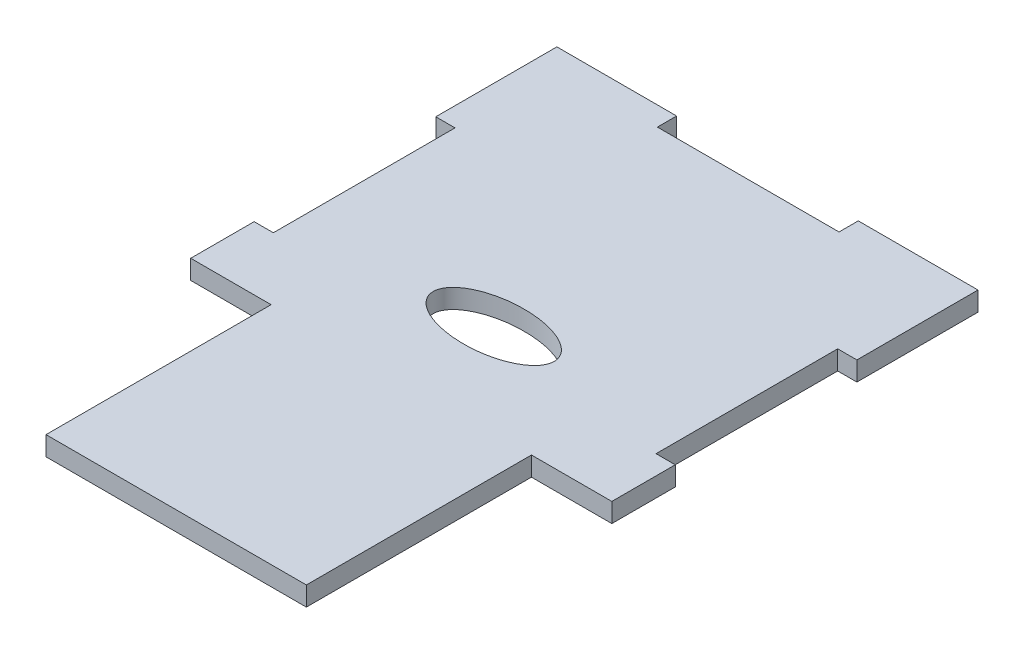
ISO-10303-21;
HEADER;
FILE_DESCRIPTION(('STEP AP214'),'2;1');
FILE_NAME('part.step','',(''),(''),'','','');
FILE_SCHEMA(('AUTOMOTIVE_DESIGN { 1 0 10303 214 1 1 1 1 }'));
ENDSEC;
DATA;
#1=APPLICATION_CONTEXT('core data for automotive mechanical design processes');
#2=APPLICATION_PROTOCOL_DEFINITION('international standard','automotive_design',2000,#1);
#3=PRODUCT_CONTEXT('',#1,'mechanical');
#4=PRODUCT('Part','Part','',(#3));
#5=PRODUCT_RELATED_PRODUCT_CATEGORY('part','',(#4));
#6=PRODUCT_DEFINITION_FORMATION('','',#4);
#7=PRODUCT_DEFINITION_CONTEXT('part definition',#1,'design');
#8=PRODUCT_DEFINITION('design','',#6,#7);
#9=PRODUCT_DEFINITION_SHAPE('','',#8);
#10=(LENGTH_UNIT() NAMED_UNIT(*) SI_UNIT(.MILLI.,.METRE.));
#11=(NAMED_UNIT(*) PLANE_ANGLE_UNIT() SI_UNIT($,.RADIAN.));
#12=(NAMED_UNIT(*) SI_UNIT($,.STERADIAN.) SOLID_ANGLE_UNIT());
#13=UNCERTAINTY_MEASURE_WITH_UNIT(LENGTH_MEASURE(1.E-05),#10,'distance_accuracy_value','');
#14=(GEOMETRIC_REPRESENTATION_CONTEXT(3) GLOBAL_UNCERTAINTY_ASSIGNED_CONTEXT((#13)) GLOBAL_UNIT_ASSIGNED_CONTEXT((#10,
#11,#12)) REPRESENTATION_CONTEXT('',''));
#15=CARTESIAN_POINT('',(0.,0.,0.));
#16=DIRECTION('',(0.,0.,1.));
#17=DIRECTION('',(1.,0.,0.));
#18=AXIS2_PLACEMENT_3D('',#15,#16,#17);
#19=CARTESIAN_POINT('',(0.,3.175,-44.475));
#20=DIRECTION('',(0.,0.,-1.));
#21=DIRECTION('',(-1.,0.,0.));
#22=AXIS2_PLACEMENT_3D('',#19,#20,#21);
#23=PLANE('',#22);
#24=DIRECTION('',(1.,0.,0.));
#25=VECTOR('',#24,1.);
#26=CARTESIAN_POINT('',(0.,0.,-44.475));
#27=LINE('',#26,#25);
#28=CARTESIAN_POINT('',(66.375,0.,-44.475));
#29=VERTEX_POINT('',#28);
#30=CARTESIAN_POINT('',(69.55,0.,-44.475));
#31=VERTEX_POINT('',#30);
#32=EDGE_CURVE('E218',#29,#31,#27,.T.);
#33=ORIENTED_EDGE('',*,*,#32,.F.);
#34=DIRECTION('',(0.,-1.,0.));
#35=VECTOR('',#34,1.);
#36=CARTESIAN_POINT('',(66.375,3.175,-44.475));
#37=LINE('',#36,#35);
#38=CARTESIAN_POINT('',(66.375,3.175,-44.475));
#39=VERTEX_POINT('',#38);
#40=EDGE_CURVE('E11',#39,#29,#37,.T.);
#41=ORIENTED_EDGE('',*,*,#40,.F.);
#42=DIRECTION('',(1.,0.,0.));
#43=VECTOR('',#42,1.);
#44=CARTESIAN_POINT('',(0.,3.175,-44.475));
#45=LINE('',#44,#43);
#46=CARTESIAN_POINT('',(69.55,3.175,-44.475));
#47=VERTEX_POINT('',#46);
#48=EDGE_CURVE('E354',#39,#47,#45,.T.);
#49=ORIENTED_EDGE('',*,*,#48,.T.);
#50=DIRECTION('',(0.,-1.,0.));
#51=VECTOR('',#50,1.);
#52=CARTESIAN_POINT('',(69.55,3.175,-44.475));
#53=LINE('',#52,#51);
#54=EDGE_CURVE('E130',#47,#31,#53,.T.);
#55=ORIENTED_EDGE('',*,*,#54,.T.);
#56=EDGE_LOOP('',(#33,#41,#49,#55));
#57=FACE_BOUND('',#56,.T.);
#58=ADVANCED_FACE('F41',(#57),#23,.T.);
#59=CARTESIAN_POINT('',(66.375,3.175,0.));
#60=DIRECTION('',(1.,0.,0.));
#61=DIRECTION('',(0.,0.,-1.));
#62=AXIS2_PLACEMENT_3D('',#59,#60,#61);
#63=PLANE('',#62);
#64=DIRECTION('',(0.,0.,1.));
#65=VECTOR('',#64,1.);
#66=CARTESIAN_POINT('',(66.375,0.,0.));
#67=LINE('',#66,#65);
#68=CARTESIAN_POINT('',(66.375,0.,-74.475));
#69=VERTEX_POINT('',#68);
#70=EDGE_CURVE('E222',#69,#29,#67,.T.);
#71=ORIENTED_EDGE('',*,*,#70,.F.);
#72=DIRECTION('',(0.,-1.,0.));
#73=VECTOR('',#72,1.);
#74=CARTESIAN_POINT('',(66.375,3.175,-74.475));
#75=LINE('',#74,#73);
#76=CARTESIAN_POINT('',(66.375,3.175,-74.475));
#77=VERTEX_POINT('',#76);
#78=EDGE_CURVE('E52',#77,#69,#75,.T.);
#79=ORIENTED_EDGE('',*,*,#78,.F.);
#80=DIRECTION('',(0.,0.,1.));
#81=VECTOR('',#80,1.);
#82=CARTESIAN_POINT('',(66.375,3.175,0.));
#83=LINE('',#82,#81);
#84=EDGE_CURVE('E349',#77,#39,#83,.T.);
#85=ORIENTED_EDGE('',*,*,#84,.T.);
#86=ORIENTED_EDGE('',*,*,#40,.T.);
#87=EDGE_LOOP('',(#71,#79,#85,#86));
#88=FACE_BOUND('',#87,.T.);
#89=ADVANCED_FACE('F348',(#88),#63,.T.);
#90=CARTESIAN_POINT('',(0.,3.175,-74.475));
#91=DIRECTION('',(0.,0.,-1.));
#92=DIRECTION('',(-1.,0.,0.));
#93=AXIS2_PLACEMENT_3D('',#90,#91,#92);
#94=PLANE('',#93);
#95=DIRECTION('',(1.,0.,0.));
#96=VECTOR('',#95,1.);
#97=CARTESIAN_POINT('',(0.,0.,-74.475));
#98=LINE('',#97,#96);
#99=CARTESIAN_POINT('',(69.55,0.,-74.475));
#100=VERTEX_POINT('',#99);
#101=EDGE_CURVE('E226',#69,#100,#98,.T.);
#102=ORIENTED_EDGE('',*,*,#101,.T.);
#103=DIRECTION('',(0.,-1.,0.));
#104=VECTOR('',#103,1.);
#105=CARTESIAN_POINT('',(69.55,3.175,-74.475));
#106=LINE('',#105,#104);
#107=CARTESIAN_POINT('',(69.55,3.175,-74.475));
#108=VERTEX_POINT('',#107);
#109=EDGE_CURVE('E331',#108,#100,#106,.T.);
#110=ORIENTED_EDGE('',*,*,#109,.F.);
#111=DIRECTION('',(1.,0.,0.));
#112=VECTOR('',#111,1.);
#113=CARTESIAN_POINT('',(0.,3.175,-74.475));
#114=LINE('',#113,#112);
#115=EDGE_CURVE('E341',#77,#108,#114,.T.);
#116=ORIENTED_EDGE('',*,*,#115,.F.);
#117=ORIENTED_EDGE('',*,*,#78,.T.);
#118=EDGE_LOOP('',(#102,#110,#116,#117));
#119=FACE_BOUND('',#118,.T.);
#120=ADVANCED_FACE('F338',(#119),#94,.F.);
#121=CARTESIAN_POINT('',(69.55,3.175,0.));
#122=DIRECTION('',(-1.,0.,0.));
#123=DIRECTION('',(0.,0.,1.));
#124=AXIS2_PLACEMENT_3D('',#121,#122,#123);
#125=PLANE('',#124);
#126=DIRECTION('',(0.,0.,-1.));
#127=VECTOR('',#126,1.);
#128=CARTESIAN_POINT('',(69.55,0.,0.));
#129=LINE('',#128,#127);
#130=CARTESIAN_POINT('',(69.55,0.,-94.475));
#131=VERTEX_POINT('',#130);
#132=EDGE_CURVE('E230',#100,#131,#129,.T.);
#133=ORIENTED_EDGE('',*,*,#132,.T.);
#134=DIRECTION('',(0.,-1.,0.));
#135=VECTOR('',#134,1.);
#136=CARTESIAN_POINT('',(69.55,3.175,-94.475));
#137=LINE('',#136,#135);
#138=CARTESIAN_POINT('',(69.55,3.175,-94.475));
#139=VERTEX_POINT('',#138);
#140=EDGE_CURVE('E328',#139,#131,#137,.T.);
#141=ORIENTED_EDGE('',*,*,#140,.F.);
#142=DIRECTION('',(0.,0.,-1.));
#143=VECTOR('',#142,1.);
#144=CARTESIAN_POINT('',(69.55,3.175,0.));
#145=LINE('',#144,#143);
#146=EDGE_CURVE('E211',#108,#139,#145,.T.);
#147=ORIENTED_EDGE('',*,*,#146,.F.);
#148=ORIENTED_EDGE('',*,*,#109,.T.);
#149=EDGE_LOOP('',(#133,#141,#147,#148));
#150=FACE_BOUND('',#149,.T.);
#151=ADVANCED_FACE('F467',(#150),#125,.F.);
#152=CARTESIAN_POINT('',(0.,3.175,-94.475));
#153=DIRECTION('',(0.,0.,-1.));
#154=DIRECTION('',(-1.,0.,0.));
#155=AXIS2_PLACEMENT_3D('',#152,#153,#154);
#156=PLANE('',#155);
#157=DIRECTION('',(1.,0.,0.));
#158=VECTOR('',#157,1.);
#159=CARTESIAN_POINT('',(0.,0.,-94.475));
#160=LINE('',#159,#158);
#161=CARTESIAN_POINT('',(49.775,0.,-94.475));
#162=VERTEX_POINT('',#161);
#163=EDGE_CURVE('E234',#162,#131,#160,.T.);
#164=ORIENTED_EDGE('',*,*,#163,.F.);
#165=DIRECTION('',(0.,-1.,0.));
#166=VECTOR('',#165,1.);
#167=CARTESIAN_POINT('',(49.775,3.175,-94.475));
#168=LINE('',#167,#166);
#169=CARTESIAN_POINT('',(49.775,3.175,-94.475));
#170=VERTEX_POINT('',#169);
#171=EDGE_CURVE('E325',#170,#162,#168,.T.);
#172=ORIENTED_EDGE('',*,*,#171,.F.);
#173=DIRECTION('',(1.,0.,0.));
#174=VECTOR('',#173,1.);
#175=CARTESIAN_POINT('',(0.,3.175,-94.475));
#176=LINE('',#175,#174);
#177=EDGE_CURVE('E366',#170,#139,#176,.T.);
#178=ORIENTED_EDGE('',*,*,#177,.T.);
#179=ORIENTED_EDGE('',*,*,#140,.T.);
#180=EDGE_LOOP('',(#164,#172,#178,#179));
#181=FACE_BOUND('',#180,.T.);
#182=ADVANCED_FACE('F463',(#181),#156,.T.);
#183=CARTESIAN_POINT('',(49.775,3.175,0.));
#184=DIRECTION('',(-1.,0.,0.));
#185=DIRECTION('',(0.,0.,1.));
#186=AXIS2_PLACEMENT_3D('',#183,#184,#185);
#187=PLANE('',#186);
#188=DIRECTION('',(0.,0.,-1.));
#189=VECTOR('',#188,1.);
#190=CARTESIAN_POINT('',(49.775,0.,0.));
#191=LINE('',#190,#189);
#192=CARTESIAN_POINT('',(49.775,0.,-91.3));
#193=VERTEX_POINT('',#192);
#194=EDGE_CURVE('E239',#193,#162,#191,.T.);
#195=ORIENTED_EDGE('',*,*,#194,.F.);
#196=DIRECTION('',(0.,-1.,0.));
#197=VECTOR('',#196,1.);
#198=CARTESIAN_POINT('',(49.775,3.175,-91.3));
#199=LINE('',#198,#197);
#200=CARTESIAN_POINT('',(49.775,3.175,-91.3));
#201=VERTEX_POINT('',#200);
#202=EDGE_CURVE('E322',#201,#193,#199,.T.);
#203=ORIENTED_EDGE('',*,*,#202,.F.);
#204=DIRECTION('',(0.,0.,-1.));
#205=VECTOR('',#204,1.);
#206=CARTESIAN_POINT('',(49.775,3.175,0.));
#207=LINE('',#206,#205);
#208=EDGE_CURVE('E370',#201,#170,#207,.T.);
#209=ORIENTED_EDGE('',*,*,#208,.T.);
#210=ORIENTED_EDGE('',*,*,#171,.T.);
#211=EDGE_LOOP('',(#195,#203,#209,#210));
#212=FACE_BOUND('',#211,.T.);
#213=ADVANCED_FACE('F460',(#212),#187,.T.);
#214=CARTESIAN_POINT('',(0.,3.175,-91.3));
#215=DIRECTION('',(0.,0.,-1.));
#216=DIRECTION('',(-1.,0.,0.));
#217=AXIS2_PLACEMENT_3D('',#214,#215,#216);
#218=PLANE('',#217);
#219=DIRECTION('',(1.,0.,0.));
#220=VECTOR('',#219,1.);
#221=CARTESIAN_POINT('',(0.,0.,-91.3));
#222=LINE('',#221,#220);
#223=CARTESIAN_POINT('',(19.775,0.,-91.3));
#224=VERTEX_POINT('',#223);
#225=EDGE_CURVE('E244',#224,#193,#222,.T.);
#226=ORIENTED_EDGE('',*,*,#225,.F.);
#227=DIRECTION('',(0.,-1.,0.));
#228=VECTOR('',#227,1.);
#229=CARTESIAN_POINT('',(19.775,3.175,-91.3));
#230=LINE('',#229,#228);
#231=CARTESIAN_POINT('',(19.775,3.175,-91.3));
#232=VERTEX_POINT('',#231);
#233=EDGE_CURVE('E319',#232,#224,#230,.T.);
#234=ORIENTED_EDGE('',*,*,#233,.F.);
#235=DIRECTION('',(1.,0.,0.));
#236=VECTOR('',#235,1.);
#237=CARTESIAN_POINT('',(0.,3.175,-91.3));
#238=LINE('',#237,#236);
#239=EDGE_CURVE('E375',#232,#201,#238,.T.);
#240=ORIENTED_EDGE('',*,*,#239,.T.);
#241=ORIENTED_EDGE('',*,*,#202,.T.);
#242=EDGE_LOOP('',(#226,#234,#240,#241));
#243=FACE_BOUND('',#242,.T.);
#244=ADVANCED_FACE('F456',(#243),#218,.T.);
#245=CARTESIAN_POINT('',(19.775,3.175,0.));
#246=DIRECTION('',(-1.,0.,0.));
#247=DIRECTION('',(0.,0.,1.));
#248=AXIS2_PLACEMENT_3D('',#245,#246,#247);
#249=PLANE('',#248);
#250=DIRECTION('',(0.,0.,-1.));
#251=VECTOR('',#250,1.);
#252=CARTESIAN_POINT('',(19.775,0.,0.));
#253=LINE('',#252,#251);
#254=CARTESIAN_POINT('',(19.775,0.,-94.475));
#255=VERTEX_POINT('',#254);
#256=EDGE_CURVE('E248',#224,#255,#253,.T.);
#257=ORIENTED_EDGE('',*,*,#256,.T.);
#258=DIRECTION('',(0.,-1.,0.));
#259=VECTOR('',#258,1.);
#260=CARTESIAN_POINT('',(19.775,3.175,-94.475));
#261=LINE('',#260,#259);
#262=CARTESIAN_POINT('',(19.775,3.175,-94.475));
#263=VERTEX_POINT('',#262);
#264=EDGE_CURVE('E316',#263,#255,#261,.T.);
#265=ORIENTED_EDGE('',*,*,#264,.F.);
#266=DIRECTION('',(0.,0.,-1.));
#267=VECTOR('',#266,1.);
#268=CARTESIAN_POINT('',(19.775,3.175,0.));
#269=LINE('',#268,#267);
#270=EDGE_CURVE('E379',#232,#263,#269,.T.);
#271=ORIENTED_EDGE('',*,*,#270,.F.);
#272=ORIENTED_EDGE('',*,*,#233,.T.);
#273=EDGE_LOOP('',(#257,#265,#271,#272));
#274=FACE_BOUND('',#273,.T.);
#275=ADVANCED_FACE('F490',(#274),#249,.F.);
#276=CARTESIAN_POINT('',(0.,0.,-94.475));
#277=VERTEX_POINT('',#276);
#278=EDGE_CURVE('E240',#277,#255,#160,.T.);
#279=ORIENTED_EDGE('',*,*,#278,.F.);
#280=DIRECTION('',(0.,-1.,0.));
#281=VECTOR('',#280,1.);
#282=CARTESIAN_POINT('',(0.,3.175,-94.475));
#283=LINE('',#282,#281);
#284=CARTESIAN_POINT('',(0.,3.175,-94.475));
#285=VERTEX_POINT('',#284);
#286=EDGE_CURVE('E313',#285,#277,#283,.T.);
#287=ORIENTED_EDGE('',*,*,#286,.F.);
#288=EDGE_CURVE('E371',#285,#263,#176,.T.);
#289=ORIENTED_EDGE('',*,*,#288,.T.);
#290=ORIENTED_EDGE('',*,*,#264,.T.);
#291=EDGE_LOOP('',(#279,#287,#289,#290));
#292=FACE_BOUND('',#291,.T.);
#293=ADVANCED_FACE('F412',(#292),#156,.T.);
#294=CARTESIAN_POINT('',(0.,3.175,0.));
#295=DIRECTION('',(-1.,0.,0.));
#296=DIRECTION('',(0.,0.,1.));
#297=AXIS2_PLACEMENT_3D('',#294,#295,#296);
#298=PLANE('',#297);
#299=DIRECTION('',(0.,0.,-1.));
#300=VECTOR('',#299,1.);
#301=CARTESIAN_POINT('',(0.,0.,0.));
#302=LINE('',#301,#300);
#303=CARTESIAN_POINT('',(0.,0.,-74.475));
#304=VERTEX_POINT('',#303);
#305=EDGE_CURVE('E252',#304,#277,#302,.T.);
#306=ORIENTED_EDGE('',*,*,#305,.F.);
#307=DIRECTION('',(0.,-1.,0.));
#308=VECTOR('',#307,1.);
#309=CARTESIAN_POINT('',(0.,3.175,-74.475));
#310=LINE('',#309,#308);
#311=CARTESIAN_POINT('',(0.,3.175,-74.475));
#312=VERTEX_POINT('',#311);
#313=EDGE_CURVE('E310',#312,#304,#310,.T.);
#314=ORIENTED_EDGE('',*,*,#313,.F.);
#315=DIRECTION('',(0.,0.,-1.));
#316=VECTOR('',#315,1.);
#317=CARTESIAN_POINT('',(0.,3.175,0.));
#318=LINE('',#317,#316);
#319=EDGE_CURVE('E382',#312,#285,#318,.T.);
#320=ORIENTED_EDGE('',*,*,#319,.T.);
#321=ORIENTED_EDGE('',*,*,#286,.T.);
#322=EDGE_LOOP('',(#306,#314,#320,#321));
#323=FACE_BOUND('',#322,.T.);
#324=ADVANCED_FACE('F420',(#323),#298,.T.);
#325=CARTESIAN_POINT('',(0.,3.175,-74.475));
#326=DIRECTION('',(0.,0.,1.));
#327=DIRECTION('',(1.,0.,0.));
#328=AXIS2_PLACEMENT_3D('',#325,#326,#327);
#329=PLANE('',#328);
#330=DIRECTION('',(-1.,0.,0.));
#331=VECTOR('',#330,1.);
#332=CARTESIAN_POINT('',(0.,0.,-74.475));
#333=LINE('',#332,#331);
#334=CARTESIAN_POINT('',(3.175,0.,-74.475));
#335=VERTEX_POINT('',#334);
#336=EDGE_CURVE('E256',#335,#304,#333,.T.);
#337=ORIENTED_EDGE('',*,*,#336,.F.);
#338=DIRECTION('',(0.,-1.,0.));
#339=VECTOR('',#338,1.);
#340=CARTESIAN_POINT('',(3.175,3.175,-74.475));
#341=LINE('',#340,#339);
#342=CARTESIAN_POINT('',(3.175,3.175,-74.475));
#343=VERTEX_POINT('',#342);
#344=EDGE_CURVE('E307',#343,#335,#341,.T.);
#345=ORIENTED_EDGE('',*,*,#344,.F.);
#346=DIRECTION('',(-1.,0.,0.));
#347=VECTOR('',#346,1.);
#348=CARTESIAN_POINT('',(0.,3.175,-74.475));
#349=LINE('',#348,#347);
#350=EDGE_CURVE('E386',#343,#312,#349,.T.);
#351=ORIENTED_EDGE('',*,*,#350,.T.);
#352=ORIENTED_EDGE('',*,*,#313,.T.);
#353=EDGE_LOOP('',(#337,#345,#351,#352));
#354=FACE_BOUND('',#353,.T.);
#355=ADVANCED_FACE('F423',(#354),#329,.T.);
#356=CARTESIAN_POINT('',(3.175,3.175,0.));
#357=DIRECTION('',(-1.,0.,0.));
#358=DIRECTION('',(0.,0.,1.));
#359=AXIS2_PLACEMENT_3D('',#356,#357,#358);
#360=PLANE('',#359);
#361=DIRECTION('',(0.,0.,-1.));
#362=VECTOR('',#361,1.);
#363=CARTESIAN_POINT('',(3.175,0.,0.));
#364=LINE('',#363,#362);
#365=CARTESIAN_POINT('',(3.175,0.,-44.475));
#366=VERTEX_POINT('',#365);
#367=EDGE_CURVE('E261',#366,#335,#364,.T.);
#368=ORIENTED_EDGE('',*,*,#367,.F.);
#369=DIRECTION('',(0.,-1.,0.));
#370=VECTOR('',#369,1.);
#371=CARTESIAN_POINT('',(3.175,3.175,-44.475));
#372=LINE('',#371,#370);
#373=CARTESIAN_POINT('',(3.175,3.175,-44.475));
#374=VERTEX_POINT('',#373);
#375=EDGE_CURVE('E304',#374,#366,#372,.T.);
#376=ORIENTED_EDGE('',*,*,#375,.F.);
#377=DIRECTION('',(0.,0.,-1.));
#378=VECTOR('',#377,1.);
#379=CARTESIAN_POINT('',(3.175,3.175,0.));
#380=LINE('',#379,#378);
#381=EDGE_CURVE('E391',#374,#343,#380,.T.);
#382=ORIENTED_EDGE('',*,*,#381,.T.);
#383=ORIENTED_EDGE('',*,*,#344,.T.);
#384=EDGE_LOOP('',(#368,#376,#382,#383));
#385=FACE_BOUND('',#384,.T.);
#386=ADVANCED_FACE('F427',(#385),#360,.T.);
#387=CARTESIAN_POINT('',(0.,3.175,-44.475));
#388=DIRECTION('',(0.,0.,1.));
#389=DIRECTION('',(1.,0.,0.));
#390=AXIS2_PLACEMENT_3D('',#387,#388,#389);
#391=PLANE('',#390);
#392=DIRECTION('',(-1.,0.,0.));
#393=VECTOR('',#392,1.);
#394=CARTESIAN_POINT('',(0.,0.,-44.475));
#395=LINE('',#394,#393);
#396=CARTESIAN_POINT('',(0.,0.,-44.475));
#397=VERTEX_POINT('',#396);
#398=EDGE_CURVE('E265',#366,#397,#395,.T.);
#399=ORIENTED_EDGE('',*,*,#398,.T.);
#400=DIRECTION('',(0.,-1.,0.));
#401=VECTOR('',#400,1.);
#402=CARTESIAN_POINT('',(0.,3.175,-44.475));
#403=LINE('',#402,#401);
#404=CARTESIAN_POINT('',(0.,3.175,-44.475));
#405=VERTEX_POINT('',#404);
#406=EDGE_CURVE('E301',#405,#397,#403,.T.);
#407=ORIENTED_EDGE('',*,*,#406,.F.);
#408=DIRECTION('',(-1.,0.,0.));
#409=VECTOR('',#408,1.);
#410=CARTESIAN_POINT('',(0.,3.175,-44.475));
#411=LINE('',#410,#409);
#412=EDGE_CURVE('E395',#374,#405,#411,.T.);
#413=ORIENTED_EDGE('',*,*,#412,.F.);
#414=ORIENTED_EDGE('',*,*,#375,.T.);
#415=EDGE_LOOP('',(#399,#407,#413,#414));
#416=FACE_BOUND('',#415,.T.);
#417=ADVANCED_FACE('F432',(#416),#391,.F.);
#418=CARTESIAN_POINT('',(0.,0.,-34.));
#419=VERTEX_POINT('',#418);
#420=EDGE_CURVE('E257',#419,#397,#302,.T.);
#421=ORIENTED_EDGE('',*,*,#420,.F.);
#422=DIRECTION('',(0.,-1.,0.));
#423=VECTOR('',#422,1.);
#424=CARTESIAN_POINT('',(0.,3.175,-34.));
#425=LINE('',#424,#423);
#426=CARTESIAN_POINT('',(0.,3.175,-34.));
#427=VERTEX_POINT('',#426);
#428=EDGE_CURVE('E298',#427,#419,#425,.T.);
#429=ORIENTED_EDGE('',*,*,#428,.F.);
#430=EDGE_CURVE('E387',#427,#405,#318,.T.);
#431=ORIENTED_EDGE('',*,*,#430,.T.);
#432=ORIENTED_EDGE('',*,*,#406,.T.);
#433=EDGE_LOOP('',(#421,#429,#431,#432));
#434=FACE_BOUND('',#433,.T.);
#435=ADVANCED_FACE('F438',(#434),#298,.T.);
#436=CARTESIAN_POINT('',(0.,3.175,-34.));
#437=DIRECTION('',(0.,0.,-1.));
#438=DIRECTION('',(-1.,0.,0.));
#439=AXIS2_PLACEMENT_3D('',#436,#437,#438);
#440=PLANE('',#439);
#441=DIRECTION('',(1.,0.,0.));
#442=VECTOR('',#441,1.);
#443=CARTESIAN_POINT('',(0.,0.,-34.));
#444=LINE('',#443,#442);
#445=CARTESIAN_POINT('',(13.275,0.,-34.));
#446=VERTEX_POINT('',#445);
#447=EDGE_CURVE('E269',#419,#446,#444,.T.);
#448=ORIENTED_EDGE('',*,*,#447,.T.);
#449=DIRECTION('',(0.,-1.,0.));
#450=VECTOR('',#449,1.);
#451=CARTESIAN_POINT('',(13.275,3.175,-34.));
#452=LINE('',#451,#450);
#453=CARTESIAN_POINT('',(13.275,3.175,-34.));
#454=VERTEX_POINT('',#453);
#455=EDGE_CURVE('E295',#454,#446,#452,.T.);
#456=ORIENTED_EDGE('',*,*,#455,.F.);
#457=DIRECTION('',(1.,0.,0.));
#458=VECTOR('',#457,1.);
#459=CARTESIAN_POINT('',(0.,3.175,-34.));
#460=LINE('',#459,#458);
#461=EDGE_CURVE('E398',#427,#454,#460,.T.);
#462=ORIENTED_EDGE('',*,*,#461,.F.);
#463=ORIENTED_EDGE('',*,*,#428,.T.);
#464=EDGE_LOOP('',(#448,#456,#462,#463));
#465=FACE_BOUND('',#464,.T.);
#466=ADVANCED_FACE('F442',(#465),#440,.F.);
#467=CARTESIAN_POINT('',(13.275,3.175,0.));
#468=DIRECTION('',(-1.,0.,0.));
#469=DIRECTION('',(0.,0.,1.));
#470=AXIS2_PLACEMENT_3D('',#467,#468,#469);
#471=PLANE('',#470);
#472=DIRECTION('',(0.,0.,-1.));
#473=VECTOR('',#472,1.);
#474=CARTESIAN_POINT('',(13.275,0.,0.));
#475=LINE('',#474,#473);
#476=CARTESIAN_POINT('',(13.275,0.,3.175));
#477=VERTEX_POINT('',#476);
#478=EDGE_CURVE('E273',#477,#446,#475,.T.);
#479=ORIENTED_EDGE('',*,*,#478,.F.);
#480=DIRECTION('',(0.,-1.,0.));
#481=VECTOR('',#480,1.);
#482=CARTESIAN_POINT('',(13.275,3.175,3.175));
#483=LINE('',#482,#481);
#484=CARTESIAN_POINT('',(13.275,3.175,3.175));
#485=VERTEX_POINT('',#484);
#486=EDGE_CURVE('E292',#485,#477,#483,.T.);
#487=ORIENTED_EDGE('',*,*,#486,.F.);
#488=DIRECTION('',(0.,0.,-1.));
#489=VECTOR('',#488,1.);
#490=CARTESIAN_POINT('',(13.275,3.175,0.));
#491=LINE('',#490,#489);
#492=EDGE_CURVE('E401',#485,#454,#491,.T.);
#493=ORIENTED_EDGE('',*,*,#492,.T.);
#494=ORIENTED_EDGE('',*,*,#455,.T.);
#495=EDGE_LOOP('',(#479,#487,#493,#494));
#496=FACE_BOUND('',#495,.T.);
#497=ADVANCED_FACE('F445',(#496),#471,.T.);
#498=CARTESIAN_POINT('',(0.,3.175,3.175));
#499=DIRECTION('',(0.,0.,-1.));
#500=DIRECTION('',(-1.,0.,0.));
#501=AXIS2_PLACEMENT_3D('',#498,#499,#500);
#502=PLANE('',#501);
#503=DIRECTION('',(1.,0.,0.));
#504=VECTOR('',#503,1.);
#505=CARTESIAN_POINT('',(0.,0.,3.175));
#506=LINE('',#505,#504);
#507=CARTESIAN_POINT('',(56.275,0.,3.175));
#508=VERTEX_POINT('',#507);
#509=EDGE_CURVE('E277',#477,#508,#506,.T.);
#510=ORIENTED_EDGE('',*,*,#509,.T.);
#511=DIRECTION('',(0.,-1.,0.));
#512=VECTOR('',#511,1.);
#513=CARTESIAN_POINT('',(56.275,3.175,3.175));
#514=LINE('',#513,#512);
#515=CARTESIAN_POINT('',(56.275,3.175,3.175));
#516=VERTEX_POINT('',#515);
#517=EDGE_CURVE('E204',#516,#508,#514,.T.);
#518=ORIENTED_EDGE('',*,*,#517,.F.);
#519=DIRECTION('',(1.,0.,0.));
#520=VECTOR('',#519,1.);
#521=CARTESIAN_POINT('',(0.,3.175,3.175));
#522=LINE('',#521,#520);
#523=EDGE_CURVE('E190',#485,#516,#522,.T.);
#524=ORIENTED_EDGE('',*,*,#523,.F.);
#525=ORIENTED_EDGE('',*,*,#486,.T.);
#526=EDGE_LOOP('',(#510,#518,#524,#525));
#527=FACE_BOUND('',#526,.T.);
#528=ADVANCED_FACE('F448',(#527),#502,.F.);
#529=CARTESIAN_POINT('',(56.275,3.175,0.));
#530=DIRECTION('',(-1.,0.,0.));
#531=DIRECTION('',(0.,0.,1.));
#532=AXIS2_PLACEMENT_3D('',#529,#530,#531);
#533=PLANE('',#532);
#534=DIRECTION('',(0.,0.,-1.));
#535=VECTOR('',#534,1.);
#536=CARTESIAN_POINT('',(56.275,0.,0.));
#537=LINE('',#536,#535);
#538=CARTESIAN_POINT('',(56.275,0.,-34.));
#539=VERTEX_POINT('',#538);
#540=EDGE_CURVE('E199',#508,#539,#537,.T.);
#541=ORIENTED_EDGE('',*,*,#540,.T.);
#542=DIRECTION('',(0.,-1.,0.));
#543=VECTOR('',#542,1.);
#544=CARTESIAN_POINT('',(56.275,3.175,-34.));
#545=LINE('',#544,#543);
#546=CARTESIAN_POINT('',(56.275,3.175,-34.));
#547=VERTEX_POINT('',#546);
#548=EDGE_CURVE('E197',#547,#539,#545,.T.);
#549=ORIENTED_EDGE('',*,*,#548,.F.);
#550=DIRECTION('',(0.,0.,-1.));
#551=VECTOR('',#550,1.);
#552=CARTESIAN_POINT('',(56.275,3.175,0.));
#553=LINE('',#552,#551);
#554=EDGE_CURVE('E183',#516,#547,#553,.T.);
#555=ORIENTED_EDGE('',*,*,#554,.F.);
#556=ORIENTED_EDGE('',*,*,#517,.T.);
#557=EDGE_LOOP('',(#541,#549,#555,#556));
#558=FACE_BOUND('',#557,.T.);
#559=ADVANCED_FACE('F198',(#558),#533,.F.);
#560=CARTESIAN_POINT('',(0.,3.175,-34.));
#561=DIRECTION('',(0.,0.,1.));
#562=DIRECTION('',(1.,0.,0.));
#563=AXIS2_PLACEMENT_3D('',#560,#561,#562);
#564=PLANE('',#563);
#565=DIRECTION('',(-1.,0.,0.));
#566=VECTOR('',#565,1.);
#567=CARTESIAN_POINT('',(0.,0.,-34.));
#568=LINE('',#567,#566);
#569=CARTESIAN_POINT('',(69.55,0.,-34.));
#570=VERTEX_POINT('',#569);
#571=EDGE_CURVE('E283',#570,#539,#568,.T.);
#572=ORIENTED_EDGE('',*,*,#571,.F.);
#573=DIRECTION('',(0.,-1.,0.));
#574=VECTOR('',#573,1.);
#575=CARTESIAN_POINT('',(69.55,3.175,-34.));
#576=LINE('',#575,#574);
#577=CARTESIAN_POINT('',(69.55,3.175,-34.));
#578=VERTEX_POINT('',#577);
#579=EDGE_CURVE('E123',#578,#570,#576,.T.);
#580=ORIENTED_EDGE('',*,*,#579,.F.);
#581=DIRECTION('',(-1.,0.,0.));
#582=VECTOR('',#581,1.);
#583=CARTESIAN_POINT('',(0.,3.175,-34.));
#584=LINE('',#583,#582);
#585=EDGE_CURVE('E187',#578,#547,#584,.T.);
#586=ORIENTED_EDGE('',*,*,#585,.T.);
#587=ORIENTED_EDGE('',*,*,#548,.T.);
#588=EDGE_LOOP('',(#572,#580,#586,#587));
#589=FACE_BOUND('',#588,.T.);
#590=ADVANCED_FACE('F206',(#589),#564,.T.);
#591=CARTESIAN_POINT('',(34.775,3.175,-49.2712556768075));
#592=DIRECTION('',(0.,1.,0.));
#593=DIRECTION('',(-1.,0.,0.));
#594=AXIS2_PLACEMENT_3D('',#591,#592,#593);
#595=ELLIPSE('',#594,10.,5.);
#596=DIRECTION('',(0.,-1.,0.));
#597=VECTOR('',#596,1.);
#598=SURFACE_OF_LINEAR_EXTRUSION('',#595,#597);
#599=CARTESIAN_POINT('',(24.775,3.175,-49.2712556768075));
#600=VERTEX_POINT('',#599);
#601=EDGE_CURVE('E351',#600,#600,#595,.T.);
#602=ORIENTED_EDGE('',*,*,#601,.T.);
#603=EDGE_LOOP('',(#602));
#604=FACE_BOUND('',#603,.T.);
#605=CARTESIAN_POINT('',(34.775,0.,-49.2712556768075));
#606=DIRECTION('',(0.,1.,0.));
#607=DIRECTION('',(-1.,0.,0.));
#608=AXIS2_PLACEMENT_3D('',#605,#606,#607);
#609=ELLIPSE('',#608,10.,5.);
#610=CARTESIAN_POINT('',(24.775,0.,-49.2712556768075));
#611=VERTEX_POINT('',#610);
#612=EDGE_CURVE('E214',#611,#611,#609,.T.);
#613=ORIENTED_EDGE('',*,*,#612,.F.);
#614=EDGE_LOOP('',(#613));
#615=FACE_BOUND('',#614,.T.);
#616=ADVANCED_FACE('F43',(#604,#615),#598,.T.);
#617=EDGE_CURVE('E235',#570,#31,#129,.T.);
#618=ORIENTED_EDGE('',*,*,#617,.T.);
#619=ORIENTED_EDGE('',*,*,#54,.F.);
#620=EDGE_CURVE('E60',#578,#47,#145,.T.);
#621=ORIENTED_EDGE('',*,*,#620,.F.);
#622=ORIENTED_EDGE('',*,*,#579,.T.);
#623=EDGE_LOOP('',(#618,#619,#621,#622));
#624=FACE_BOUND('',#623,.T.);
#625=ADVANCED_FACE('F470',(#624),#125,.F.);
#626=CARTESIAN_POINT('',(0.,3.175,0.));
#627=DIRECTION('',(0.,1.,0.));
#628=DIRECTION('',(0.,0.,1.));
#629=AXIS2_PLACEMENT_3D('',#626,#627,#628);
#630=PLANE('',#629);
#631=ORIENTED_EDGE('',*,*,#601,.F.);
#632=EDGE_LOOP('',(#631));
#633=FACE_BOUND('',#632,.T.);
#634=ORIENTED_EDGE('',*,*,#48,.F.);
#635=ORIENTED_EDGE('',*,*,#84,.F.);
#636=ORIENTED_EDGE('',*,*,#115,.T.);
#637=ORIENTED_EDGE('',*,*,#146,.T.);
#638=ORIENTED_EDGE('',*,*,#177,.F.);
#639=ORIENTED_EDGE('',*,*,#208,.F.);
#640=ORIENTED_EDGE('',*,*,#239,.F.);
#641=ORIENTED_EDGE('',*,*,#270,.T.);
#642=ORIENTED_EDGE('',*,*,#288,.F.);
#643=ORIENTED_EDGE('',*,*,#319,.F.);
#644=ORIENTED_EDGE('',*,*,#350,.F.);
#645=ORIENTED_EDGE('',*,*,#381,.F.);
#646=ORIENTED_EDGE('',*,*,#412,.T.);
#647=ORIENTED_EDGE('',*,*,#430,.F.);
#648=ORIENTED_EDGE('',*,*,#461,.T.);
#649=ORIENTED_EDGE('',*,*,#492,.F.);
#650=ORIENTED_EDGE('',*,*,#523,.T.);
#651=ORIENTED_EDGE('',*,*,#554,.T.);
#652=ORIENTED_EDGE('',*,*,#585,.F.);
#653=ORIENTED_EDGE('',*,*,#620,.T.);
#654=EDGE_LOOP('',(#634,#635,#636,#637,#638,#639,#640,#641,#642,#643,#644,#645,#646,#647,#648,
#649,#650,#651,#652,#653));
#655=FACE_BOUND('',#654,.T.);
#656=ADVANCED_FACE('F185',(#633,#655),#630,.T.);
#657=CARTESIAN_POINT('',(0.,0.,0.));
#658=DIRECTION('',(0.,1.,0.));
#659=DIRECTION('',(0.,0.,1.));
#660=AXIS2_PLACEMENT_3D('',#657,#658,#659);
#661=PLANE('',#660);
#662=ORIENTED_EDGE('',*,*,#612,.T.);
#663=EDGE_LOOP('',(#662));
#664=FACE_BOUND('',#663,.T.);
#665=ORIENTED_EDGE('',*,*,#32,.T.);
#666=ORIENTED_EDGE('',*,*,#617,.F.);
#667=ORIENTED_EDGE('',*,*,#571,.T.);
#668=ORIENTED_EDGE('',*,*,#540,.F.);
#669=ORIENTED_EDGE('',*,*,#509,.F.);
#670=ORIENTED_EDGE('',*,*,#478,.T.);
#671=ORIENTED_EDGE('',*,*,#447,.F.);
#672=ORIENTED_EDGE('',*,*,#420,.T.);
#673=ORIENTED_EDGE('',*,*,#398,.F.);
#674=ORIENTED_EDGE('',*,*,#367,.T.);
#675=ORIENTED_EDGE('',*,*,#336,.T.);
#676=ORIENTED_EDGE('',*,*,#305,.T.);
#677=ORIENTED_EDGE('',*,*,#278,.T.);
#678=ORIENTED_EDGE('',*,*,#256,.F.);
#679=ORIENTED_EDGE('',*,*,#225,.T.);
#680=ORIENTED_EDGE('',*,*,#194,.T.);
#681=ORIENTED_EDGE('',*,*,#163,.T.);
#682=ORIENTED_EDGE('',*,*,#132,.F.);
#683=ORIENTED_EDGE('',*,*,#101,.F.);
#684=ORIENTED_EDGE('',*,*,#70,.T.);
#685=EDGE_LOOP('',(#665,#666,#667,#668,#669,#670,#671,#672,#673,#674,#675,#676,#677,#678,#679,
#680,#681,#682,#683,#684));
#686=FACE_BOUND('',#685,.T.);
#687=ADVANCED_FACE('F347',(#664,#686),#661,.F.);
#688=CLOSED_SHELL('',(#58,#89,#120,#151,#182,#213,#244,#275,#293,#324,#355,#386,#417,#435,#466,
#497,#528,#559,#590,#616,#625,#656,#687));
#689=MANIFOLD_SOLID_BREP('B2',#688);
#690=ADVANCED_BREP_SHAPE_REPRESENTATION('',(#18,#689),#14);
#691=SHAPE_DEFINITION_REPRESENTATION(#9,#690);
ENDSEC;
END-ISO-10303-21;
